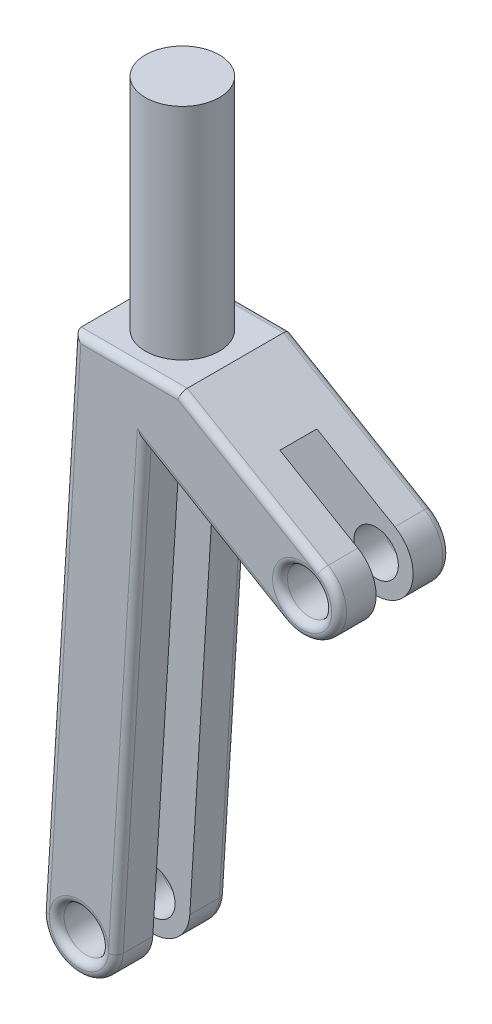
ISO-10303-21;
HEADER;
FILE_DESCRIPTION(('STEP AP214'),'2;1');
FILE_NAME('part.step','',(''),(''),'','','');
FILE_SCHEMA(('AUTOMOTIVE_DESIGN { 1 0 10303 214 1 1 1 1 }'));
ENDSEC;
DATA;
#1=APPLICATION_CONTEXT('core data for automotive mechanical design processes');
#2=APPLICATION_PROTOCOL_DEFINITION('international standard','automotive_design',2000,#1);
#3=PRODUCT_CONTEXT('',#1,'mechanical');
#4=PRODUCT('Part','Part','',(#3));
#5=PRODUCT_RELATED_PRODUCT_CATEGORY('part','',(#4));
#6=PRODUCT_DEFINITION_FORMATION('','',#4);
#7=PRODUCT_DEFINITION_CONTEXT('part definition',#1,'design');
#8=PRODUCT_DEFINITION('design','',#6,#7);
#9=PRODUCT_DEFINITION_SHAPE('','',#8);
#10=(LENGTH_UNIT() NAMED_UNIT(*) SI_UNIT(.MILLI.,.METRE.));
#11=(NAMED_UNIT(*) PLANE_ANGLE_UNIT() SI_UNIT($,.RADIAN.));
#12=(NAMED_UNIT(*) SI_UNIT($,.STERADIAN.) SOLID_ANGLE_UNIT());
#13=UNCERTAINTY_MEASURE_WITH_UNIT(LENGTH_MEASURE(1.E-05),#10,'distance_accuracy_value','');
#14=(GEOMETRIC_REPRESENTATION_CONTEXT(3) GLOBAL_UNCERTAINTY_ASSIGNED_CONTEXT((#13)) GLOBAL_UNIT_ASSIGNED_CONTEXT((#10,
#11,#12)) REPRESENTATION_CONTEXT('',''));
#15=CARTESIAN_POINT('',(0.,0.,0.));
#16=DIRECTION('',(0.,0.,1.));
#17=DIRECTION('',(1.,0.,0.));
#18=AXIS2_PLACEMENT_3D('',#15,#16,#17);
#19=CARTESIAN_POINT('',(61.4599769573422,104.642233340965,2.5));
#20=DIRECTION('',(0.506442852633937,0.862273527957342,0.));
#21=DIRECTION('',(-0.862273527957342,0.506442852633937,0.));
#22=AXIS2_PLACEMENT_3D('',#19,#20,#21);
#23=PLANE('',#22);
#24=DIRECTION('',(0.,0.,-1.));
#25=VECTOR('',#24,1.);
#26=CARTESIAN_POINT('',(28.6398220739108,123.918637317355,2.5));
#27=LINE('',#26,#25);
#28=CARTESIAN_POINT('',(28.6398220739108,123.918637317355,2.5));
#29=VERTEX_POINT('',#28);
#30=CARTESIAN_POINT('',(28.6398220739108,123.918637317355,0.5));
#31=VERTEX_POINT('',#30);
#32=EDGE_CURVE('E277',#29,#31,#27,.T.);
#33=ORIENTED_EDGE('',*,*,#32,.T.);
#34=DIRECTION('',(0.862273527957342,-0.506442852633937,0.));
#35=VECTOR('',#34,1.);
#36=CARTESIAN_POINT('',(19.1138774160616,129.513551726919,0.5));
#37=LINE('',#36,#35);
#38=CARTESIAN_POINT('',(19.1138774160616,129.513551726919,0.5));
#39=VERTEX_POINT('',#38);
#40=EDGE_CURVE('E329',#31,#39,#37,.F.);
#41=ORIENTED_EDGE('',*,*,#40,.T.);
#42=DIRECTION('',(0.,0.,-1.));
#43=VECTOR('',#42,1.);
#44=CARTESIAN_POINT('',(19.1138774160616,129.513551726919,3.75));
#45=LINE('',#44,#43);
#46=CARTESIAN_POINT('',(19.1138774160616,129.513551726919,7.));
#47=VERTEX_POINT('',#46);
#48=EDGE_CURVE('E208',#47,#39,#45,.T.);
#49=ORIENTED_EDGE('',*,*,#48,.F.);
#50=DIRECTION('',(0.862273527957342,-0.506442852633937,0.));
#51=VECTOR('',#50,1.);
#52=CARTESIAN_POINT('',(28.6398220739108,123.918637317355,7.));
#53=LINE('',#52,#51);
#54=CARTESIAN_POINT('',(28.6398220739108,123.918637317355,7.));
#55=VERTEX_POINT('',#54);
#56=EDGE_CURVE('E327',#47,#55,#53,.T.);
#57=ORIENTED_EDGE('',*,*,#56,.T.);
#58=DIRECTION('',(0.,0.,1.));
#59=VECTOR('',#58,1.);
#60=CARTESIAN_POINT('',(28.6398220739108,123.918637317355,5.));
#61=LINE('',#60,#59);
#62=CARTESIAN_POINT('',(28.6398220739108,123.918637317355,5.));
#63=VERTEX_POINT('',#62);
#64=EDGE_CURVE('E222',#63,#55,#61,.T.);
#65=ORIENTED_EDGE('',*,*,#64,.F.);
#66=DIRECTION('',(0.862273527957342,-0.506442852633937,0.));
#67=VECTOR('',#66,1.);
#68=CARTESIAN_POINT('',(61.4599769573422,104.642233340965,5.));
#69=LINE('',#68,#67);
#70=CARTESIAN_POINT('',(23.3703968015795,127.013551726919,5.));
#71=VERTEX_POINT('',#70);
#72=EDGE_CURVE('E214',#71,#63,#69,.T.);
#73=ORIENTED_EDGE('',*,*,#72,.F.);
#74=DIRECTION('',(0.,0.,-1.));
#75=VECTOR('',#74,1.);
#76=CARTESIAN_POINT('',(23.3703968015795,127.013551726919,3.75));
#77=LINE('',#76,#75);
#78=CARTESIAN_POINT('',(23.3703968015795,127.013551726919,2.5));
#79=VERTEX_POINT('',#78);
#80=EDGE_CURVE('E198',#71,#79,#77,.T.);
#81=ORIENTED_EDGE('',*,*,#80,.T.);
#82=DIRECTION('',(0.862273527957342,-0.506442852633937,0.));
#83=VECTOR('',#82,1.);
#84=CARTESIAN_POINT('',(61.4599769573422,104.642233340965,2.5));
#85=LINE('',#84,#83);
#86=EDGE_CURVE('E257',#79,#29,#85,.T.);
#87=ORIENTED_EDGE('',*,*,#86,.T.);
#88=EDGE_LOOP('',(#33,#41,#49,#57,#65,#73,#81,#87));
#89=FACE_BOUND('',#88,.T.);
#90=ADVANCED_FACE('F45',(#89),#23,.T.);
#91=CARTESIAN_POINT('',(3.93847108899417,-0.243000831228595,2.5));
#92=DIRECTION('',(0.998102016630387,-0.0615821759793753,0.));
#93=DIRECTION('',(0.0615821759793753,0.998102016630387,0.));
#94=AXIS2_PLACEMENT_3D('',#91,#92,#93);
#95=PLANE('',#94);
#96=DIRECTION('',(0.,0.,-1.));
#97=VECTOR('',#96,1.);
#98=CARTESIAN_POINT('',(11.9443569813899,129.513551726919,2.5));
#99=LINE('',#98,#97);
#100=CARTESIAN_POINT('',(11.9443569813899,129.513551726919,7.));
#101=VERTEX_POINT('',#100);
#102=CARTESIAN_POINT('',(11.9443569813899,129.513551726919,0.5));
#103=VERTEX_POINT('',#102);
#104=EDGE_CURVE('E291',#101,#103,#99,.T.);
#105=ORIENTED_EDGE('',*,*,#104,.T.);
#106=DIRECTION('',(-0.0615821759793753,-0.998102016630387,0.));
#107=VECTOR('',#106,1.);
#108=CARTESIAN_POINT('',(3.93847108899417,-0.243000831228595,0.5));
#109=LINE('',#108,#107);
#110=CARTESIAN_POINT('',(9.78898082211173,94.5799811448554,0.5));
#111=VERTEX_POINT('',#110);
#112=EDGE_CURVE('E337',#103,#111,#109,.T.);
#113=ORIENTED_EDGE('',*,*,#112,.T.);
#114=DIRECTION('',(0.,0.,-1.));
#115=VECTOR('',#114,1.);
#116=CARTESIAN_POINT('',(9.78898082211173,94.5799811448554,2.5));
#117=LINE('',#116,#115);
#118=CARTESIAN_POINT('',(9.78898082211173,94.5799811448554,2.5));
#119=VERTEX_POINT('',#118);
#120=EDGE_CURVE('E288',#119,#111,#117,.T.);
#121=ORIENTED_EDGE('',*,*,#120,.F.);
#122=DIRECTION('',(-0.0615821759793753,-0.998102016630387,0.));
#123=VECTOR('',#122,1.);
#124=CARTESIAN_POINT('',(3.93847108899417,-0.243000831228595,2.5));
#125=LINE('',#124,#123);
#126=CARTESIAN_POINT('',(11.7901087809221,127.013551726919,2.5));
#127=VERTEX_POINT('',#126);
#128=EDGE_CURVE('E259',#127,#119,#125,.T.);
#129=ORIENTED_EDGE('',*,*,#128,.F.);
#130=DIRECTION('',(0.,0.,-1.));
#131=VECTOR('',#130,1.);
#132=CARTESIAN_POINT('',(11.7901087809221,127.013551726919,3.75));
#133=LINE('',#132,#131);
#134=CARTESIAN_POINT('',(11.7901087809221,127.013551726919,5.));
#135=VERTEX_POINT('',#134);
#136=EDGE_CURVE('E207',#135,#127,#133,.T.);
#137=ORIENTED_EDGE('',*,*,#136,.F.);
#138=DIRECTION('',(-0.0615821759793753,-0.998102016630387,0.));
#139=VECTOR('',#138,1.);
#140=CARTESIAN_POINT('',(3.93847108899417,-0.243000831228595,5.));
#141=LINE('',#140,#139);
#142=CARTESIAN_POINT('',(9.78898082211173,94.5799811448554,5.));
#143=VERTEX_POINT('',#142);
#144=EDGE_CURVE('E217',#135,#143,#141,.T.);
#145=ORIENTED_EDGE('',*,*,#144,.T.);
#146=DIRECTION('',(0.,0.,1.));
#147=VECTOR('',#146,1.);
#148=CARTESIAN_POINT('',(9.78898082211173,94.5799811448554,5.));
#149=LINE('',#148,#147);
#150=CARTESIAN_POINT('',(9.78898082211173,94.5799811448554,7.));
#151=VERTEX_POINT('',#150);
#152=EDGE_CURVE('E250',#143,#151,#149,.T.);
#153=ORIENTED_EDGE('',*,*,#152,.T.);
#154=DIRECTION('',(-0.0615821759793753,-0.998102016630387,0.));
#155=VECTOR('',#154,1.);
#156=CARTESIAN_POINT('',(3.93847108899417,-0.243000831228595,7.));
#157=LINE('',#156,#155);
#158=EDGE_CURVE('E335',#151,#101,#157,.F.);
#159=ORIENTED_EDGE('',*,*,#158,.T.);
#160=EDGE_LOOP('',(#105,#113,#121,#129,#137,#145,#153,#159));
#161=FACE_BOUND('',#160,.T.);
#162=ADVANCED_FACE('F428',(#161),#95,.F.);
#163=CARTESIAN_POINT('',(12.2842358636877,94.426025704907,2.5));
#164=DIRECTION('',(0.,0.,-1.));
#165=DIRECTION('',(-1.,0.,0.));
#166=AXIS2_PLACEMENT_3D('',#163,#164,#165);
#167=CYLINDRICAL_SURFACE('',#166,2.5);
#168=ORIENTED_EDGE('',*,*,#120,.T.);
#169=CARTESIAN_POINT('',(12.2842358636877,94.426025704907,0.5));
#170=DIRECTION('',(0.,0.,1.));
#171=DIRECTION('',(1.,0.,0.));
#172=AXIS2_PLACEMENT_3D('',#169,#170,#171);
#173=CIRCLE('',#172,2.5);
#174=CARTESIAN_POINT('',(14.7794909052637,94.2720702649586,0.5));
#175=VERTEX_POINT('',#174);
#176=EDGE_CURVE('E318',#111,#175,#173,.T.);
#177=ORIENTED_EDGE('',*,*,#176,.T.);
#178=DIRECTION('',(0.,0.,-1.));
#179=VECTOR('',#178,1.);
#180=CARTESIAN_POINT('',(14.7794909052637,94.2720702649586,2.5));
#181=LINE('',#180,#179);
#182=CARTESIAN_POINT('',(14.7794909052637,94.2720702649586,2.5));
#183=VERTEX_POINT('',#182);
#184=EDGE_CURVE('E285',#183,#175,#181,.T.);
#185=ORIENTED_EDGE('',*,*,#184,.F.);
#186=CARTESIAN_POINT('',(12.2842358636877,94.426025704907,2.5));
#187=DIRECTION('',(0.,0.,1.));
#188=DIRECTION('',(1.,0.,0.));
#189=AXIS2_PLACEMENT_3D('',#186,#187,#188);
#190=CIRCLE('',#189,2.5);
#191=EDGE_CURVE('E261',#119,#183,#190,.T.);
#192=ORIENTED_EDGE('',*,*,#191,.F.);
#193=EDGE_LOOP('',(#168,#177,#185,#192));
#194=FACE_BOUND('',#193,.T.);
#195=ADVANCED_FACE('F460',(#194),#167,.T.);
#196=CARTESIAN_POINT('',(8.92898117214608,-0.550911711125472,2.5));
#197=DIRECTION('',(0.998102016630387,-0.0615821759793755,0.));
#198=DIRECTION('',(0.0615821759793755,0.998102016630387,0.));
#199=AXIS2_PLACEMENT_3D('',#196,#197,#198);
#200=PLANE('',#199);
#201=ORIENTED_EDGE('',*,*,#184,.T.);
#202=DIRECTION('',(-0.0615821759793755,-0.998102016630387,0.));
#203=VECTOR('',#202,1.);
#204=CARTESIAN_POINT('',(16.6841429890366,125.141994160303,0.5));
#205=LINE('',#204,#203);
#206=CARTESIAN_POINT('',(16.6841429890366,125.141994160303,0.5));
#207=VERTEX_POINT('',#206);
#208=EDGE_CURVE('E321',#175,#207,#205,.F.);
#209=ORIENTED_EDGE('',*,*,#208,.T.);
#210=DIRECTION('',(0.,0.,-1.));
#211=VECTOR('',#210,1.);
#212=CARTESIAN_POINT('',(16.6841429890366,125.141994160303,2.5));
#213=LINE('',#212,#211);
#214=CARTESIAN_POINT('',(16.6841429890366,125.141994160303,2.5));
#215=VERTEX_POINT('',#214);
#216=EDGE_CURVE('E282',#215,#207,#213,.T.);
#217=ORIENTED_EDGE('',*,*,#216,.F.);
#218=DIRECTION('',(-0.0615821759793756,-0.998102016630387,0.));
#219=VECTOR('',#218,1.);
#220=CARTESIAN_POINT('',(8.92898117214608,-0.550911711125472,2.5));
#221=LINE('',#220,#219);
#222=EDGE_CURVE('E263',#215,#183,#221,.T.);
#223=ORIENTED_EDGE('',*,*,#222,.T.);
#224=EDGE_LOOP('',(#201,#209,#217,#223));
#225=FACE_BOUND('',#224,.T.);
#226=ADVANCED_FACE('F471',(#225),#200,.T.);
#227=CARTESIAN_POINT('',(58.9277626941718,100.330865701179,2.5));
#228=DIRECTION('',(0.506442852633929,0.862273527957346,0.));
#229=DIRECTION('',(-0.862273527957346,0.506442852633929,0.));
#230=AXIS2_PLACEMENT_3D('',#227,#228,#229);
#231=PLANE('',#230);
#232=ORIENTED_EDGE('',*,*,#216,.T.);
#233=DIRECTION('',(0.862273527957346,-0.506442852633929,0.));
#234=VECTOR('',#233,1.);
#235=CARTESIAN_POINT('',(58.9277626941718,100.330865701179,0.5));
#236=LINE('',#235,#234);
#237=CARTESIAN_POINT('',(26.1076078107412,119.607269677568,0.5));
#238=VERTEX_POINT('',#237);
#239=EDGE_CURVE('E323',#207,#238,#236,.T.);
#240=ORIENTED_EDGE('',*,*,#239,.T.);
#241=DIRECTION('',(0.,0.,-1.));
#242=VECTOR('',#241,1.);
#243=CARTESIAN_POINT('',(26.1076078107412,119.607269677568,2.5));
#244=LINE('',#243,#242);
#245=CARTESIAN_POINT('',(26.1076078107412,119.607269677568,2.5));
#246=VERTEX_POINT('',#245);
#247=EDGE_CURVE('E279',#246,#238,#244,.T.);
#248=ORIENTED_EDGE('',*,*,#247,.F.);
#249=DIRECTION('',(0.862273527957346,-0.506442852633929,0.));
#250=VECTOR('',#249,1.);
#251=CARTESIAN_POINT('',(58.9277626941718,100.330865701179,2.5));
#252=LINE('',#251,#250);
#253=EDGE_CURVE('E266',#215,#246,#252,.T.);
#254=ORIENTED_EDGE('',*,*,#253,.F.);
#255=EDGE_LOOP('',(#232,#240,#248,#254));
#256=FACE_BOUND('',#255,.T.);
#257=ADVANCED_FACE('F474',(#256),#231,.F.);
#258=CARTESIAN_POINT('',(12.2842358636877,94.426025704907,2.5));
#259=DIRECTION('',(0.,0.,-1.));
#260=DIRECTION('',(-1.,0.,0.));
#261=AXIS2_PLACEMENT_3D('',#258,#259,#260);
#262=CYLINDRICAL_SURFACE('',#261,1.50000000000004);
#263=CARTESIAN_POINT('',(12.2842358636877,94.426025704907,0.5));
#264=DIRECTION('',(0.,0.,1.));
#265=DIRECTION('',(1.,0.,0.));
#266=AXIS2_PLACEMENT_3D('',#263,#264,#265);
#267=CIRCLE('',#266,1.50000000000004);
#268=CARTESIAN_POINT('',(13.7842358636877,94.426025704907,0.5));
#269=VERTEX_POINT('',#268);
#270=EDGE_CURVE('E315',#269,#269,#267,.F.);
#271=ORIENTED_EDGE('',*,*,#270,.T.);
#272=EDGE_LOOP('',(#271));
#273=FACE_BOUND('',#272,.T.);
#274=CARTESIAN_POINT('',(12.2842358636877,94.426025704907,2.5));
#275=DIRECTION('',(0.,0.,1.));
#276=DIRECTION('',(1.,0.,0.));
#277=AXIS2_PLACEMENT_3D('',#274,#275,#276);
#278=CIRCLE('',#277,1.50000000000004);
#279=CARTESIAN_POINT('',(13.7842358636877,94.426025704907,2.5));
#280=VERTEX_POINT('',#279);
#281=EDGE_CURVE('E271',#280,#280,#278,.T.);
#282=ORIENTED_EDGE('',*,*,#281,.T.);
#283=EDGE_LOOP('',(#282));
#284=FACE_BOUND('',#283,.T.);
#285=ADVANCED_FACE('F515',(#273,#284),#262,.F.);
#286=CARTESIAN_POINT('',(27.373714942326,121.762953497462,2.5));
#287=DIRECTION('',(0.,0.,-1.));
#288=DIRECTION('',(-1.,0.,0.));
#289=AXIS2_PLACEMENT_3D('',#286,#287,#288);
#290=CYLINDRICAL_SURFACE('',#289,2.49999999999998);
#291=ORIENTED_EDGE('',*,*,#247,.T.);
#292=CARTESIAN_POINT('',(27.373714942326,121.762953497462,0.5));
#293=DIRECTION('',(0.,0.,1.));
#294=DIRECTION('',(1.,0.,0.));
#295=AXIS2_PLACEMENT_3D('',#292,#293,#294);
#296=CIRCLE('',#295,2.49999999999998);
#297=EDGE_CURVE('E325',#238,#31,#296,.T.);
#298=ORIENTED_EDGE('',*,*,#297,.T.);
#299=ORIENTED_EDGE('',*,*,#32,.F.);
#300=CARTESIAN_POINT('',(27.373714942326,121.762953497462,2.5));
#301=DIRECTION('',(0.,0.,1.));
#302=DIRECTION('',(1.,0.,0.));
#303=AXIS2_PLACEMENT_3D('',#300,#301,#302);
#304=CIRCLE('',#303,2.49999999999998);
#305=EDGE_CURVE('E268',#246,#29,#304,.T.);
#306=ORIENTED_EDGE('',*,*,#305,.F.);
#307=EDGE_LOOP('',(#291,#298,#299,#306));
#308=FACE_BOUND('',#307,.T.);
#309=ADVANCED_FACE('F483',(#308),#290,.T.);
#310=CARTESIAN_POINT('',(27.373714942326,121.762953497462,2.5));
#311=DIRECTION('',(0.,0.,-1.));
#312=DIRECTION('',(-1.,0.,0.));
#313=AXIS2_PLACEMENT_3D('',#310,#311,#312);
#314=CYLINDRICAL_SURFACE('',#313,1.50000000000002);
#315=CARTESIAN_POINT('',(27.373714942326,121.762953497462,0.5));
#316=DIRECTION('',(0.,0.,1.));
#317=DIRECTION('',(1.,0.,0.));
#318=AXIS2_PLACEMENT_3D('',#315,#316,#317);
#319=CIRCLE('',#318,1.50000000000002);
#320=CARTESIAN_POINT('',(28.873714942326,121.762953497462,0.5));
#321=VERTEX_POINT('',#320);
#322=EDGE_CURVE('E312',#321,#321,#319,.F.);
#323=ORIENTED_EDGE('',*,*,#322,.T.);
#324=EDGE_LOOP('',(#323));
#325=FACE_BOUND('',#324,.T.);
#326=CARTESIAN_POINT('',(27.373714942326,121.762953497462,2.5));
#327=DIRECTION('',(0.,0.,1.));
#328=DIRECTION('',(1.,0.,0.));
#329=AXIS2_PLACEMENT_3D('',#326,#327,#328);
#330=CIRCLE('',#329,1.50000000000002);
#331=CARTESIAN_POINT('',(28.873714942326,121.762953497462,2.5));
#332=VERTEX_POINT('',#331);
#333=EDGE_CURVE('E274',#332,#332,#330,.T.);
#334=ORIENTED_EDGE('',*,*,#333,.T.);
#335=EDGE_LOOP('',(#334));
#336=FACE_BOUND('',#335,.T.);
#337=ADVANCED_FACE('F518',(#325,#336),#314,.F.);
#338=CARTESIAN_POINT('',(0.,0.,2.5));
#339=DIRECTION('',(0.,0.,1.));
#340=DIRECTION('',(1.,0.,0.));
#341=AXIS2_PLACEMENT_3D('',#338,#339,#340);
#342=PLANE('',#341);
#343=DIRECTION('',(1.,0.,0.));
#344=VECTOR('',#343,1.);
#345=CARTESIAN_POINT('',(11.7901087809221,127.013551726919,2.5));
#346=LINE('',#345,#344);
#347=EDGE_CURVE('E204',#127,#79,#346,.T.);
#348=ORIENTED_EDGE('',*,*,#347,.F.);
#349=ORIENTED_EDGE('',*,*,#128,.T.);
#350=ORIENTED_EDGE('',*,*,#191,.T.);
#351=ORIENTED_EDGE('',*,*,#222,.F.);
#352=ORIENTED_EDGE('',*,*,#253,.T.);
#353=ORIENTED_EDGE('',*,*,#305,.T.);
#354=ORIENTED_EDGE('',*,*,#86,.F.);
#355=EDGE_LOOP('',(#348,#349,#350,#351,#352,#353,#354));
#356=FACE_BOUND('',#355,.T.);
#357=ORIENTED_EDGE('',*,*,#281,.F.);
#358=EDGE_LOOP('',(#357));
#359=FACE_BOUND('',#358,.T.);
#360=ORIENTED_EDGE('',*,*,#333,.F.);
#361=EDGE_LOOP('',(#360));
#362=FACE_BOUND('',#361,.T.);
#363=ADVANCED_FACE('F479',(#356,#359,#362),#342,.T.);
#364=CARTESIAN_POINT('',(0.,0.,0.));
#365=DIRECTION('',(0.,0.,1.));
#366=DIRECTION('',(1.,0.,0.));
#367=AXIS2_PLACEMENT_3D('',#364,#365,#366);
#368=PLANE('',#367);
#369=DIRECTION('',(-0.0615821759793755,-0.998102016630387,0.));
#370=VECTOR('',#369,1.);
#371=CARTESIAN_POINT('',(14.2804398969485,94.3028613529483,0.));
#372=LINE('',#371,#370);
#373=CARTESIAN_POINT('',(16.2352367958224,125.985514585636,0.));
#374=VERTEX_POINT('',#373);
#375=CARTESIAN_POINT('',(14.2804398969485,94.3028613529483,0.));
#376=VERTEX_POINT('',#375);
#377=EDGE_CURVE('E308',#374,#376,#372,.T.);
#378=ORIENTED_EDGE('',*,*,#377,.T.);
#379=CARTESIAN_POINT('',(12.2842358636877,94.426025704907,0.));
#380=DIRECTION('',(0.,0.,1.));
#381=DIRECTION('',(1.,0.,0.));
#382=AXIS2_PLACEMENT_3D('',#379,#380,#381);
#383=CIRCLE('',#382,2.00000000000004);
#384=CARTESIAN_POINT('',(14.2842358636877,94.426025704907,0.));
#385=VERTEX_POINT('',#384);
#386=EDGE_CURVE('E310',#376,#385,#383,.T.);
#387=ORIENTED_EDGE('',*,*,#386,.T.);
#388=CARTESIAN_POINT('',(12.2842358636877,94.426025704907,0.));
#389=DIRECTION('',(0.,0.,1.));
#390=DIRECTION('',(1.,0.,0.));
#391=AXIS2_PLACEMENT_3D('',#388,#389,#390);
#392=CIRCLE('',#391,2.00000000000004);
#393=CARTESIAN_POINT('',(10.2880318304269,94.5491900568658,0.));
#394=VERTEX_POINT('',#393);
#395=EDGE_CURVE('E301',#385,#394,#392,.T.);
#396=ORIENTED_EDGE('',*,*,#395,.T.);
#397=DIRECTION('',(-0.0615821759793753,-0.998102016630387,0.));
#398=VECTOR('',#397,1.);
#399=CARTESIAN_POINT('',(4.43752209730937,-0.273791919218283,0.));
#400=LINE('',#399,#398);
#401=CARTESIAN_POINT('',(12.4144581375767,129.013551726919,0.));
#402=VERTEX_POINT('',#401);
#403=EDGE_CURVE('E295',#394,#402,#400,.F.);
#404=ORIENTED_EDGE('',*,*,#403,.T.);
#405=DIRECTION('',(1.,0.,0.));
#406=VECTOR('',#405,1.);
#407=CARTESIAN_POINT('',(0.,129.013551726919,0.));
#408=LINE('',#407,#406);
#409=CARTESIAN_POINT('',(18.9779030693744,129.013551726919,0.));
#410=VERTEX_POINT('',#409);
#411=EDGE_CURVE('E297',#402,#410,#408,.T.);
#412=ORIENTED_EDGE('',*,*,#411,.T.);
#413=DIRECTION('',(0.862273527957342,-0.506442852633937,0.));
#414=VECTOR('',#413,1.);
#415=CARTESIAN_POINT('',(28.3866006475938,123.487500553376,0.));
#416=LINE('',#415,#414);
#417=CARTESIAN_POINT('',(28.3866006475939,123.487500553376,0.));
#418=VERTEX_POINT('',#417);
#419=EDGE_CURVE('E299',#410,#418,#416,.T.);
#420=ORIENTED_EDGE('',*,*,#419,.T.);
#421=CARTESIAN_POINT('',(27.373714942326,121.762953497462,0.));
#422=DIRECTION('',(0.,0.,1.));
#423=DIRECTION('',(1.,0.,0.));
#424=AXIS2_PLACEMENT_3D('',#421,#422,#423);
#425=CIRCLE('',#424,2.00000000000002);
#426=CARTESIAN_POINT('',(26.3608292370581,120.038406441547,0.));
#427=VERTEX_POINT('',#426);
#428=EDGE_CURVE('E303',#418,#427,#425,.T.);
#429=ORIENTED_EDGE('',*,*,#428,.T.);
#430=DIRECTION('',(0.862273527957346,-0.506442852633929,0.));
#431=VECTOR('',#430,1.);
#432=CARTESIAN_POINT('',(59.1809841204888,100.762002465158,0.));
#433=LINE('',#432,#431);
#434=EDGE_CURVE('E306',#427,#374,#433,.F.);
#435=ORIENTED_EDGE('',*,*,#434,.T.);
#436=EDGE_LOOP('',(#378,#387,#396,#404,#412,#420,#429,#435));
#437=FACE_BOUND('',#436,.T.);
#438=ADVANCED_FACE('F447',(#437),#368,.F.);
#439=CARTESIAN_POINT('',(11.7901087809221,127.013551726919,3.75));
#440=DIRECTION('',(0.,1.,0.));
#441=DIRECTION('',(0.,0.,1.));
#442=AXIS2_PLACEMENT_3D('',#439,#440,#441);
#443=PLANE('',#442);
#444=ORIENTED_EDGE('',*,*,#347,.T.);
#445=ORIENTED_EDGE('',*,*,#80,.F.);
#446=DIRECTION('',(1.,0.,0.));
#447=VECTOR('',#446,1.);
#448=CARTESIAN_POINT('',(11.7901087809221,127.013551726919,5.));
#449=LINE('',#448,#447);
#450=EDGE_CURVE('E202',#135,#71,#449,.T.);
#451=ORIENTED_EDGE('',*,*,#450,.F.);
#452=ORIENTED_EDGE('',*,*,#136,.T.);
#453=EDGE_LOOP('',(#444,#445,#451,#452));
#454=FACE_BOUND('',#453,.T.);
#455=ADVANCED_FACE('F200',(#454),#443,.F.);
#456=CARTESIAN_POINT('',(11.9443569813899,129.513551726919,3.75));
#457=DIRECTION('',(0.,-1.,0.));
#458=DIRECTION('',(0.,0.,-1.));
#459=AXIS2_PLACEMENT_3D('',#456,#457,#458);
#460=PLANE('',#459);
#461=CARTESIAN_POINT('',(15.5291171987257,129.513551726919,3.75));
#462=DIRECTION('',(0.,1.,0.));
#463=DIRECTION('',(0.,0.,1.));
#464=AXIS2_PLACEMENT_3D('',#461,#462,#463);
#465=CIRCLE('',#464,2.5);
#466=CARTESIAN_POINT('',(15.5291171987257,129.513551726919,6.25));
#467=VERTEX_POINT('',#466);
#468=EDGE_CURVE('E294',#467,#467,#465,.T.);
#469=ORIENTED_EDGE('',*,*,#468,.F.);
#470=EDGE_LOOP('',(#469));
#471=FACE_BOUND('',#470,.T.);
#472=ORIENTED_EDGE('',*,*,#48,.T.);
#473=DIRECTION('',(1.,0.,0.));
#474=VECTOR('',#473,1.);
#475=CARTESIAN_POINT('',(11.9443569813899,129.513551726919,0.5));
#476=LINE('',#475,#474);
#477=EDGE_CURVE('E333',#39,#103,#476,.F.);
#478=ORIENTED_EDGE('',*,*,#477,.T.);
#479=ORIENTED_EDGE('',*,*,#104,.F.);
#480=DIRECTION('',(1.,0.,0.));
#481=VECTOR('',#480,1.);
#482=CARTESIAN_POINT('',(11.9443569813899,129.513551726919,7.));
#483=LINE('',#482,#481);
#484=EDGE_CURVE('E331',#101,#47,#483,.T.);
#485=ORIENTED_EDGE('',*,*,#484,.T.);
#486=EDGE_LOOP('',(#472,#478,#479,#485));
#487=FACE_BOUND('',#486,.T.);
#488=ADVANCED_FACE('F432',(#471,#487),#460,.F.);
#489=CARTESIAN_POINT('',(12.2842358636877,94.426025704907,5.));
#490=DIRECTION('',(0.,0.,1.));
#491=DIRECTION('',(-1.,0.,0.));
#492=AXIS2_PLACEMENT_3D('',#489,#490,#491);
#493=CYLINDRICAL_SURFACE('',#492,2.5);
#494=DIRECTION('',(0.,0.,1.));
#495=VECTOR('',#494,1.);
#496=CARTESIAN_POINT('',(14.7794909052637,94.2720702649586,5.));
#497=LINE('',#496,#495);
#498=CARTESIAN_POINT('',(14.7794909052637,94.2720702649586,5.));
#499=VERTEX_POINT('',#498);
#500=CARTESIAN_POINT('',(14.7794909052637,94.2720702649586,7.));
#501=VERTEX_POINT('',#500);
#502=EDGE_CURVE('E248',#499,#501,#497,.T.);
#503=ORIENTED_EDGE('',*,*,#502,.T.);
#504=CARTESIAN_POINT('',(12.2842358636877,94.426025704907,7.));
#505=DIRECTION('',(0.,0.,-1.));
#506=DIRECTION('',(-1.,0.,0.));
#507=AXIS2_PLACEMENT_3D('',#504,#505,#506);
#508=CIRCLE('',#507,2.5);
#509=EDGE_CURVE('E11',#501,#151,#508,.T.);
#510=ORIENTED_EDGE('',*,*,#509,.T.);
#511=ORIENTED_EDGE('',*,*,#152,.F.);
#512=CARTESIAN_POINT('',(12.2842358636877,94.426025704907,5.));
#513=DIRECTION('',(0.,0.,1.));
#514=DIRECTION('',(1.,0.,0.));
#515=AXIS2_PLACEMENT_3D('',#512,#513,#514);
#516=CIRCLE('',#515,2.5);
#517=EDGE_CURVE('E224',#143,#499,#516,.T.);
#518=ORIENTED_EDGE('',*,*,#517,.T.);
#519=EDGE_LOOP('',(#503,#510,#511,#518));
#520=FACE_BOUND('',#519,.T.);
#521=ADVANCED_FACE('F533',(#520),#493,.T.);
#522=CARTESIAN_POINT('',(8.92898117214608,-0.550911711125472,5.));
#523=DIRECTION('',(0.998102016630387,-0.0615821759793755,0.));
#524=DIRECTION('',(0.0615821759793755,0.998102016630387,0.));
#525=AXIS2_PLACEMENT_3D('',#522,#523,#524);
#526=PLANE('',#525);
#527=DIRECTION('',(0.,0.,1.));
#528=VECTOR('',#527,1.);
#529=CARTESIAN_POINT('',(16.6841429890366,125.141994160303,5.));
#530=LINE('',#529,#528);
#531=CARTESIAN_POINT('',(16.6841429890366,125.141994160303,5.));
#532=VERTEX_POINT('',#531);
#533=CARTESIAN_POINT('',(16.6841429890366,125.141994160303,7.));
#534=VERTEX_POINT('',#533);
#535=EDGE_CURVE('E246',#532,#534,#530,.T.);
#536=ORIENTED_EDGE('',*,*,#535,.T.);
#537=DIRECTION('',(-0.0615821759793755,-0.998102016630387,0.));
#538=VECTOR('',#537,1.);
#539=CARTESIAN_POINT('',(14.7794909052637,94.2720702649586,7.));
#540=LINE('',#539,#538);
#541=EDGE_CURVE('E54',#534,#501,#540,.T.);
#542=ORIENTED_EDGE('',*,*,#541,.T.);
#543=ORIENTED_EDGE('',*,*,#502,.F.);
#544=DIRECTION('',(-0.0615821759793756,-0.998102016630387,0.));
#545=VECTOR('',#544,1.);
#546=CARTESIAN_POINT('',(8.92898117214608,-0.550911711125472,5.));
#547=LINE('',#546,#545);
#548=EDGE_CURVE('E230',#532,#499,#547,.T.);
#549=ORIENTED_EDGE('',*,*,#548,.F.);
#550=EDGE_LOOP('',(#536,#542,#543,#549));
#551=FACE_BOUND('',#550,.T.);
#552=ADVANCED_FACE('F537',(#551),#526,.T.);
#553=CARTESIAN_POINT('',(58.9277626941718,100.330865701179,5.));
#554=DIRECTION('',(0.506442852633929,0.862273527957346,0.));
#555=DIRECTION('',(-0.862273527957346,0.506442852633929,0.));
#556=AXIS2_PLACEMENT_3D('',#553,#554,#555);
#557=PLANE('',#556);
#558=DIRECTION('',(0.,0.,1.));
#559=VECTOR('',#558,1.);
#560=CARTESIAN_POINT('',(26.1076078107412,119.607269677568,5.));
#561=LINE('',#560,#559);
#562=CARTESIAN_POINT('',(26.1076078107412,119.607269677568,5.));
#563=VERTEX_POINT('',#562);
#564=CARTESIAN_POINT('',(26.1076078107412,119.607269677568,7.));
#565=VERTEX_POINT('',#564);
#566=EDGE_CURVE('E244',#563,#565,#561,.T.);
#567=ORIENTED_EDGE('',*,*,#566,.T.);
#568=DIRECTION('',(0.862273527957346,-0.506442852633929,0.));
#569=VECTOR('',#568,1.);
#570=CARTESIAN_POINT('',(58.9277626941718,100.330865701179,7.));
#571=LINE('',#570,#569);
#572=EDGE_CURVE('E69',#565,#534,#571,.F.);
#573=ORIENTED_EDGE('',*,*,#572,.T.);
#574=ORIENTED_EDGE('',*,*,#535,.F.);
#575=DIRECTION('',(0.862273527957346,-0.506442852633929,0.));
#576=VECTOR('',#575,1.);
#577=CARTESIAN_POINT('',(58.9277626941718,100.330865701179,5.));
#578=LINE('',#577,#576);
#579=EDGE_CURVE('E232',#532,#563,#578,.T.);
#580=ORIENTED_EDGE('',*,*,#579,.T.);
#581=EDGE_LOOP('',(#567,#573,#574,#580));
#582=FACE_BOUND('',#581,.T.);
#583=ADVANCED_FACE('F541',(#582),#557,.F.);
#584=CARTESIAN_POINT('',(12.2842358636877,94.426025704907,5.));
#585=DIRECTION('',(0.,0.,1.));
#586=DIRECTION('',(-1.,0.,0.));
#587=AXIS2_PLACEMENT_3D('',#584,#585,#586);
#588=CYLINDRICAL_SURFACE('',#587,1.50000000000004);
#589=CARTESIAN_POINT('',(12.2842358636877,94.426025704907,7.));
#590=DIRECTION('',(0.,0.,-1.));
#591=DIRECTION('',(-1.,0.,0.));
#592=AXIS2_PLACEMENT_3D('',#589,#590,#591);
#593=CIRCLE('',#592,1.50000000000004);
#594=CARTESIAN_POINT('',(10.7842358636877,94.426025704907,7.));
#595=VERTEX_POINT('',#594);
#596=EDGE_CURVE('E359',#595,#595,#593,.F.);
#597=ORIENTED_EDGE('',*,*,#596,.T.);
#598=EDGE_LOOP('',(#597));
#599=FACE_BOUND('',#598,.T.);
#600=CARTESIAN_POINT('',(12.2842358636877,94.426025704907,5.));
#601=DIRECTION('',(0.,0.,1.));
#602=DIRECTION('',(1.,0.,0.));
#603=AXIS2_PLACEMENT_3D('',#600,#601,#602);
#604=CIRCLE('',#603,1.50000000000004);
#605=CARTESIAN_POINT('',(13.7842358636877,94.426025704907,5.));
#606=VERTEX_POINT('',#605);
#607=EDGE_CURVE('E237',#606,#606,#604,.T.);
#608=ORIENTED_EDGE('',*,*,#607,.F.);
#609=EDGE_LOOP('',(#608));
#610=FACE_BOUND('',#609,.T.);
#611=ADVANCED_FACE('F544',(#599,#610),#588,.F.);
#612=CARTESIAN_POINT('',(27.373714942326,121.762953497462,5.));
#613=DIRECTION('',(0.,0.,1.));
#614=DIRECTION('',(-1.,0.,0.));
#615=AXIS2_PLACEMENT_3D('',#612,#613,#614);
#616=CYLINDRICAL_SURFACE('',#615,2.49999999999998);
#617=ORIENTED_EDGE('',*,*,#64,.T.);
#618=CARTESIAN_POINT('',(27.373714942326,121.762953497462,7.));
#619=DIRECTION('',(0.,0.,-1.));
#620=DIRECTION('',(-1.,0.,0.));
#621=AXIS2_PLACEMENT_3D('',#618,#619,#620);
#622=CIRCLE('',#621,2.49999999999998);
#623=EDGE_CURVE('E362',#55,#565,#622,.T.);
#624=ORIENTED_EDGE('',*,*,#623,.T.);
#625=ORIENTED_EDGE('',*,*,#566,.F.);
#626=CARTESIAN_POINT('',(27.373714942326,121.762953497462,5.));
#627=DIRECTION('',(0.,0.,1.));
#628=DIRECTION('',(1.,0.,0.));
#629=AXIS2_PLACEMENT_3D('',#626,#627,#628);
#630=CIRCLE('',#629,2.49999999999998);
#631=EDGE_CURVE('E235',#563,#63,#630,.T.);
#632=ORIENTED_EDGE('',*,*,#631,.T.);
#633=EDGE_LOOP('',(#617,#624,#625,#632));
#634=FACE_BOUND('',#633,.T.);
#635=ADVANCED_FACE('F545',(#634),#616,.T.);
#636=CARTESIAN_POINT('',(27.373714942326,121.762953497462,5.));
#637=DIRECTION('',(0.,0.,1.));
#638=DIRECTION('',(-1.,0.,0.));
#639=AXIS2_PLACEMENT_3D('',#636,#637,#638);
#640=CYLINDRICAL_SURFACE('',#639,1.50000000000002);
#641=CARTESIAN_POINT('',(27.373714942326,121.762953497462,7.));
#642=DIRECTION('',(0.,0.,-1.));
#643=DIRECTION('',(-1.,0.,0.));
#644=AXIS2_PLACEMENT_3D('',#641,#642,#643);
#645=CIRCLE('',#644,1.50000000000002);
#646=CARTESIAN_POINT('',(25.873714942326,121.762953497462,7.));
#647=VERTEX_POINT('',#646);
#648=EDGE_CURVE('E339',#647,#647,#645,.F.);
#649=ORIENTED_EDGE('',*,*,#648,.T.);
#650=EDGE_LOOP('',(#649));
#651=FACE_BOUND('',#650,.T.);
#652=CARTESIAN_POINT('',(27.373714942326,121.762953497462,5.));
#653=DIRECTION('',(0.,0.,1.));
#654=DIRECTION('',(1.,0.,0.));
#655=AXIS2_PLACEMENT_3D('',#652,#653,#654);
#656=CIRCLE('',#655,1.50000000000002);
#657=CARTESIAN_POINT('',(28.873714942326,121.762953497462,5.));
#658=VERTEX_POINT('',#657);
#659=EDGE_CURVE('E240',#658,#658,#656,.T.);
#660=ORIENTED_EDGE('',*,*,#659,.F.);
#661=EDGE_LOOP('',(#660));
#662=FACE_BOUND('',#661,.T.);
#663=ADVANCED_FACE('F548',(#651,#662),#640,.F.);
#664=CARTESIAN_POINT('',(0.,0.,5.));
#665=DIRECTION('',(0.,0.,-1.));
#666=DIRECTION('',(1.,0.,0.));
#667=AXIS2_PLACEMENT_3D('',#664,#665,#666);
#668=PLANE('',#667);
#669=ORIENTED_EDGE('',*,*,#450,.T.);
#670=ORIENTED_EDGE('',*,*,#72,.T.);
#671=ORIENTED_EDGE('',*,*,#631,.F.);
#672=ORIENTED_EDGE('',*,*,#579,.F.);
#673=ORIENTED_EDGE('',*,*,#548,.T.);
#674=ORIENTED_EDGE('',*,*,#517,.F.);
#675=ORIENTED_EDGE('',*,*,#144,.F.);
#676=EDGE_LOOP('',(#669,#670,#671,#672,#673,#674,#675));
#677=FACE_BOUND('',#676,.T.);
#678=ORIENTED_EDGE('',*,*,#607,.T.);
#679=EDGE_LOOP('',(#678));
#680=FACE_BOUND('',#679,.T.);
#681=ORIENTED_EDGE('',*,*,#659,.T.);
#682=EDGE_LOOP('',(#681));
#683=FACE_BOUND('',#682,.T.);
#684=ADVANCED_FACE('F212',(#677,#680,#683),#668,.T.);
#685=CARTESIAN_POINT('',(0.,0.,7.5));
#686=DIRECTION('',(0.,0.,-1.));
#687=DIRECTION('',(1.,0.,0.));
#688=AXIS2_PLACEMENT_3D('',#685,#686,#687);
#689=PLANE('',#688);
#690=DIRECTION('',(-0.0615821759793755,-0.998102016630387,0.));
#691=VECTOR('',#690,1.);
#692=CARTESIAN_POINT('',(16.1850919807214,125.172785248293,7.5));
#693=LINE('',#692,#691);
#694=CARTESIAN_POINT('',(14.2804398969485,94.3028613529483,7.5));
#695=VERTEX_POINT('',#694);
#696=CARTESIAN_POINT('',(16.2352367958224,125.985514585636,7.5));
#697=VERTEX_POINT('',#696);
#698=EDGE_CURVE('E355',#695,#697,#693,.F.);
#699=ORIENTED_EDGE('',*,*,#698,.T.);
#700=DIRECTION('',(0.862273527957346,-0.506442852633929,0.));
#701=VECTOR('',#700,1.);
#702=CARTESIAN_POINT('',(59.1809841204888,100.762002465158,7.5));
#703=LINE('',#702,#701);
#704=CARTESIAN_POINT('',(26.3608292370581,120.038406441547,7.5));
#705=VERTEX_POINT('',#704);
#706=EDGE_CURVE('E357',#697,#705,#703,.T.);
#707=ORIENTED_EDGE('',*,*,#706,.T.);
#708=CARTESIAN_POINT('',(27.373714942326,121.762953497462,7.5));
#709=DIRECTION('',(0.,0.,-1.));
#710=DIRECTION('',(-1.,0.,0.));
#711=AXIS2_PLACEMENT_3D('',#708,#709,#710);
#712=CIRCLE('',#711,2.00000000000002);
#713=CARTESIAN_POINT('',(28.3866006475939,123.487500553376,7.5));
#714=VERTEX_POINT('',#713);
#715=EDGE_CURVE('E352',#705,#714,#712,.T.);
#716=ORIENTED_EDGE('',*,*,#715,.T.);
#717=DIRECTION('',(0.862273527957342,-0.506442852633937,0.));
#718=VECTOR('',#717,1.);
#719=CARTESIAN_POINT('',(18.8606559897446,129.08241496294,7.5));
#720=LINE('',#719,#718);
#721=CARTESIAN_POINT('',(18.9779030693743,129.013551726919,7.5));
#722=VERTEX_POINT('',#721);
#723=EDGE_CURVE('E342',#714,#722,#720,.F.);
#724=ORIENTED_EDGE('',*,*,#723,.T.);
#725=DIRECTION('',(1.,0.,0.));
#726=VECTOR('',#725,1.);
#727=CARTESIAN_POINT('',(0.,129.013551726919,7.5));
#728=LINE('',#727,#726);
#729=CARTESIAN_POINT('',(12.4144581375767,129.013551726919,7.5));
#730=VERTEX_POINT('',#729);
#731=EDGE_CURVE('E344',#722,#730,#728,.F.);
#732=ORIENTED_EDGE('',*,*,#731,.T.);
#733=DIRECTION('',(-0.0615821759793753,-0.998102016630387,0.));
#734=VECTOR('',#733,1.);
#735=CARTESIAN_POINT('',(4.43752209730936,-0.273791919218283,7.5));
#736=LINE('',#735,#734);
#737=CARTESIAN_POINT('',(10.2880318304269,94.5491900568658,7.5));
#738=VERTEX_POINT('',#737);
#739=EDGE_CURVE('E346',#730,#738,#736,.T.);
#740=ORIENTED_EDGE('',*,*,#739,.T.);
#741=CARTESIAN_POINT('',(12.2842358636877,94.426025704907,7.5));
#742=DIRECTION('',(0.,0.,-1.));
#743=DIRECTION('',(-1.,0.,0.));
#744=AXIS2_PLACEMENT_3D('',#741,#742,#743);
#745=CIRCLE('',#744,2.00000000000004);
#746=CARTESIAN_POINT('',(14.2842358636877,94.426025704907,7.5));
#747=VERTEX_POINT('',#746);
#748=EDGE_CURVE('E348',#738,#747,#745,.T.);
#749=ORIENTED_EDGE('',*,*,#748,.T.);
#750=CARTESIAN_POINT('',(12.2842358636877,94.426025704907,7.5));
#751=DIRECTION('',(0.,0.,-1.));
#752=DIRECTION('',(-1.,0.,0.));
#753=AXIS2_PLACEMENT_3D('',#750,#751,#752);
#754=CIRCLE('',#753,2.00000000000004);
#755=EDGE_CURVE('E350',#747,#695,#754,.T.);
#756=ORIENTED_EDGE('',*,*,#755,.T.);
#757=EDGE_LOOP('',(#699,#707,#716,#724,#732,#740,#749,#756));
#758=FACE_BOUND('',#757,.T.);
#759=ADVANCED_FACE('F556',(#758),#689,.F.);
#760=CARTESIAN_POINT('',(15.5291171987257,144.359596286971,3.75));
#761=DIRECTION('',(0.,-1.,0.));
#762=DIRECTION('',(0.,0.,-1.));
#763=AXIS2_PLACEMENT_3D('',#760,#761,#762);
#764=CYLINDRICAL_SURFACE('',#763,2.5);
#765=CARTESIAN_POINT('',(15.5291171987257,144.359596286971,3.75));
#766=DIRECTION('',(0.,1.,0.));
#767=DIRECTION('',(0.,0.,1.));
#768=AXIS2_PLACEMENT_3D('',#765,#766,#767);
#769=CIRCLE('',#768,2.5);
#770=CARTESIAN_POINT('',(15.5291171987257,144.359596286971,6.25));
#771=VERTEX_POINT('',#770);
#772=EDGE_CURVE('E218',#771,#771,#769,.T.);
#773=ORIENTED_EDGE('',*,*,#772,.F.);
#774=EDGE_LOOP('',(#773));
#775=FACE_BOUND('',#774,.T.);
#776=ORIENTED_EDGE('',*,*,#468,.T.);
#777=EDGE_LOOP('',(#776));
#778=FACE_BOUND('',#777,.T.);
#779=ADVANCED_FACE('F559',(#775,#778),#764,.T.);
#780=CARTESIAN_POINT('',(15.5291171987257,144.359596286971,3.75));
#781=DIRECTION('',(0.,1.,0.));
#782=DIRECTION('',(0.,0.,1.));
#783=AXIS2_PLACEMENT_3D('',#780,#781,#782);
#784=PLANE('',#783);
#785=ORIENTED_EDGE('',*,*,#772,.T.);
#786=EDGE_LOOP('',(#785));
#787=FACE_BOUND('',#786,.T.);
#788=ADVANCED_FACE('F565',(#787),#784,.T.);
#789=CARTESIAN_POINT('',(12.2842358636877,94.426025704907,0.5));
#790=DIRECTION('',(0.,0.,1.));
#791=DIRECTION('',(1.,0.,0.));
#792=AXIS2_PLACEMENT_3D('',#789,#790,#791);
#793=TOROIDAL_SURFACE('',#792,2.00000000000004,0.5);
#794=ORIENTED_EDGE('',*,*,#270,.F.);
#795=EDGE_LOOP('',(#794));
#796=FACE_BOUND('',#795,.T.);
#797=CARTESIAN_POINT('',(12.2842358636877,94.426025704907,0.));
#798=DIRECTION('',(0.,0.,1.));
#799=DIRECTION('',(1.,0.,0.));
#800=AXIS2_PLACEMENT_3D('',#797,#798,#799);
#801=CIRCLE('',#800,2.00000000000004);
#802=EDGE_CURVE('E390',#394,#376,#801,.T.);
#803=ORIENTED_EDGE('',*,*,#802,.F.);
#804=ORIENTED_EDGE('',*,*,#395,.F.);
#805=ORIENTED_EDGE('',*,*,#386,.F.);
#806=EDGE_LOOP('',(#803,#804,#805));
#807=FACE_BOUND('',#806,.T.);
#808=ADVANCED_FACE('F567',(#796,#807),#793,.T.);
#809=CARTESIAN_POINT('',(12.2842358636877,94.426025704907,0.5));
#810=DIRECTION('',(0.,0.,1.));
#811=DIRECTION('',(1.,0.,0.));
#812=AXIS2_PLACEMENT_3D('',#809,#810,#811);
#813=TOROIDAL_SURFACE('',#812,2.,0.5);
#814=CARTESIAN_POINT('',(14.2804398969485,94.3028613529483,0.5));
#815=DIRECTION('',(0.0615821759793745,0.998102016630387,0.));
#816=DIRECTION('',(-0.998102016630387,0.0615821759793745,0.));
#817=AXIS2_PLACEMENT_3D('',#814,#815,#816);
#818=CIRCLE('',#817,0.5);
#819=EDGE_CURVE('E384',#175,#376,#818,.T.);
#820=ORIENTED_EDGE('',*,*,#819,.F.);
#821=ORIENTED_EDGE('',*,*,#176,.F.);
#822=CARTESIAN_POINT('',(10.2880318304269,94.5491900568658,0.5));
#823=DIRECTION('',(0.0615821759793745,0.998102016630387,0.));
#824=DIRECTION('',(-0.998102016630387,0.0615821759793745,0.));
#825=AXIS2_PLACEMENT_3D('',#822,#823,#824);
#826=CIRCLE('',#825,0.5);
#827=EDGE_CURVE('E387',#394,#111,#826,.T.);
#828=ORIENTED_EDGE('',*,*,#827,.F.);
#829=ORIENTED_EDGE('',*,*,#802,.T.);
#830=EDGE_LOOP('',(#820,#821,#828,#829));
#831=FACE_BOUND('',#830,.T.);
#832=ADVANCED_FACE('F464',(#831),#813,.T.);
#833=CARTESIAN_POINT('',(4.43752209730937,-0.273791919218283,0.5));
#834=DIRECTION('',(-0.0615821759793753,-0.998102016630387,0.));
#835=DIRECTION('',(0.998102016630387,-0.0615821759793753,0.));
#836=AXIS2_PLACEMENT_3D('',#833,#834,#835);
#837=CYLINDRICAL_SURFACE('',#836,0.5);
#838=ORIENTED_EDGE('',*,*,#827,.T.);
#839=ORIENTED_EDGE('',*,*,#112,.F.);
#840=CARTESIAN_POINT('',(12.4144581375767,129.013551726919,0.5));
#841=DIRECTION('',(-0.728554107798239,-0.684988256841176,0.));
#842=DIRECTION('',(0.684988256841176,-0.728554107798239,0.));
#843=AXIS2_PLACEMENT_3D('',#840,#841,#842);
#844=ELLIPSE('',#843,0.68629082541453,0.5);
#845=EDGE_CURVE('E381',#402,#103,#844,.F.);
#846=ORIENTED_EDGE('',*,*,#845,.F.);
#847=ORIENTED_EDGE('',*,*,#403,.F.);
#848=EDGE_LOOP('',(#838,#839,#846,#847));
#849=FACE_BOUND('',#848,.T.);
#850=ADVANCED_FACE('F453',(#849),#837,.T.);
#851=CARTESIAN_POINT('',(8.42993016383089,-0.520120623135784,0.5));
#852=DIRECTION('',(0.0615821759793755,0.998102016630387,0.));
#853=DIRECTION('',(-0.998102016630387,0.0615821759793755,0.));
#854=AXIS2_PLACEMENT_3D('',#851,#852,#853);
#855=CYLINDRICAL_SURFACE('',#854,0.5);
#856=ORIENTED_EDGE('',*,*,#819,.T.);
#857=ORIENTED_EDGE('',*,*,#377,.F.);
#858=CARTESIAN_POINT('',(16.2352367958224,125.985514585636,0.5));
#859=DIRECTION('',(0.882774691714425,0.469796598187451,0.));
#860=DIRECTION('',(-0.469796598187451,0.882774691714425,0.));
#861=AXIS2_PLACEMENT_3D('',#858,#859,#860);
#862=ELLIPSE('',#861,0.955533085905902,0.5);
#863=EDGE_CURVE('E378',#207,#374,#862,.T.);
#864=ORIENTED_EDGE('',*,*,#863,.F.);
#865=ORIENTED_EDGE('',*,*,#208,.F.);
#866=EDGE_LOOP('',(#856,#857,#864,#865));
#867=FACE_BOUND('',#866,.T.);
#868=ADVANCED_FACE('F467',(#867),#855,.T.);
#869=CARTESIAN_POINT('',(0.,129.013551726919,0.5));
#870=DIRECTION('',(1.,0.,0.));
#871=DIRECTION('',(0.,0.,-1.));
#872=AXIS2_PLACEMENT_3D('',#869,#870,#871);
#873=CYLINDRICAL_SURFACE('',#872,0.5);
#874=ORIENTED_EDGE('',*,*,#845,.T.);
#875=ORIENTED_EDGE('',*,*,#477,.F.);
#876=CARTESIAN_POINT('',(18.9779030693743,129.013551726919,0.5));
#877=DIRECTION('',(0.964954280771204,-0.262418055821868,0.));
#878=DIRECTION('',(0.262418055821868,0.964954280771204,0.));
#879=AXIS2_PLACEMENT_3D('',#876,#877,#878);
#880=ELLIPSE('',#879,0.51815926408492,0.5);
#881=EDGE_CURVE('E375',#410,#39,#880,.T.);
#882=ORIENTED_EDGE('',*,*,#881,.F.);
#883=ORIENTED_EDGE('',*,*,#411,.F.);
#884=EDGE_LOOP('',(#874,#875,#882,#883));
#885=FACE_BOUND('',#884,.T.);
#886=ADVANCED_FACE('F437',(#885),#873,.T.);
#887=CARTESIAN_POINT('',(59.1809841204888,100.762002465158,0.5));
#888=DIRECTION('',(0.862273527957346,-0.506442852633929,0.));
#889=DIRECTION('',(0.506442852633929,0.862273527957346,0.));
#890=AXIS2_PLACEMENT_3D('',#887,#888,#889);
#891=CYLINDRICAL_SURFACE('',#890,0.5);
#892=ORIENTED_EDGE('',*,*,#863,.T.);
#893=ORIENTED_EDGE('',*,*,#434,.F.);
#894=CARTESIAN_POINT('',(26.3608292370582,120.038406441547,0.5));
#895=DIRECTION('',(0.862273527957344,-0.506442852633933,0.));
#896=DIRECTION('',(0.506442852633933,0.862273527957344,0.));
#897=AXIS2_PLACEMENT_3D('',#894,#895,#896);
#898=CIRCLE('',#897,0.5);
#899=EDGE_CURVE('E372',#238,#427,#898,.T.);
#900=ORIENTED_EDGE('',*,*,#899,.F.);
#901=ORIENTED_EDGE('',*,*,#239,.F.);
#902=EDGE_LOOP('',(#892,#893,#900,#901));
#903=FACE_BOUND('',#902,.T.);
#904=ADVANCED_FACE('F682',(#903),#891,.T.);
#905=CARTESIAN_POINT('',(61.2067555310252,104.211096576986,0.5));
#906=DIRECTION('',(-0.862273527957342,0.506442852633937,0.));
#907=DIRECTION('',(-0.506442852633937,-0.862273527957342,0.));
#908=AXIS2_PLACEMENT_3D('',#905,#906,#907);
#909=CYLINDRICAL_SURFACE('',#908,0.5);
#910=ORIENTED_EDGE('',*,*,#881,.T.);
#911=ORIENTED_EDGE('',*,*,#40,.F.);
#912=CARTESIAN_POINT('',(28.3866006475939,123.487500553376,0.5));
#913=DIRECTION('',(0.862273527957343,-0.506442852633935,0.));
#914=DIRECTION('',(0.506442852633935,0.862273527957343,0.));
#915=AXIS2_PLACEMENT_3D('',#912,#913,#914);
#916=CIRCLE('',#915,0.5);
#917=EDGE_CURVE('E369',#418,#31,#916,.T.);
#918=ORIENTED_EDGE('',*,*,#917,.F.);
#919=ORIENTED_EDGE('',*,*,#419,.F.);
#920=EDGE_LOOP('',(#910,#911,#918,#919));
#921=FACE_BOUND('',#920,.T.);
#922=ADVANCED_FACE('F443',(#921),#909,.T.);
#923=CARTESIAN_POINT('',(27.373714942326,121.762953497462,0.5));
#924=DIRECTION('',(0.,0.,1.));
#925=DIRECTION('',(1.,0.,0.));
#926=AXIS2_PLACEMENT_3D('',#923,#924,#925);
#927=TOROIDAL_SURFACE('',#926,1.99999999999998,0.5);
#928=CARTESIAN_POINT('',(27.373714942326,121.762953497462,0.));
#929=DIRECTION('',(0.,0.,1.));
#930=DIRECTION('',(1.,0.,0.));
#931=AXIS2_PLACEMENT_3D('',#928,#929,#930);
#932=CIRCLE('',#931,1.99999999999998);
#933=EDGE_CURVE('E367',#418,#427,#932,.F.);
#934=ORIENTED_EDGE('',*,*,#933,.F.);
#935=ORIENTED_EDGE('',*,*,#917,.T.);
#936=ORIENTED_EDGE('',*,*,#297,.F.);
#937=ORIENTED_EDGE('',*,*,#899,.T.);
#938=EDGE_LOOP('',(#934,#935,#936,#937));
#939=FACE_BOUND('',#938,.T.);
#940=ADVANCED_FACE('F487',(#939),#927,.T.);
#941=CARTESIAN_POINT('',(27.373714942326,121.762953497462,0.5));
#942=DIRECTION('',(0.,0.,1.));
#943=DIRECTION('',(1.,0.,0.));
#944=AXIS2_PLACEMENT_3D('',#941,#942,#943);
#945=TOROIDAL_SURFACE('',#944,2.00000000000002,0.5);
#946=ORIENTED_EDGE('',*,*,#322,.F.);
#947=EDGE_LOOP('',(#946));
#948=FACE_BOUND('',#947,.T.);
#949=ORIENTED_EDGE('',*,*,#428,.F.);
#950=ORIENTED_EDGE('',*,*,#933,.T.);
#951=EDGE_LOOP('',(#949,#950));
#952=FACE_BOUND('',#951,.T.);
#953=ADVANCED_FACE('F490',(#948,#952),#945,.T.);
#954=CARTESIAN_POINT('',(12.2842358636877,94.426025704907,7.));
#955=DIRECTION('',(0.,0.,-1.));
#956=DIRECTION('',(-1.,0.,0.));
#957=AXIS2_PLACEMENT_3D('',#954,#955,#956);
#958=TOROIDAL_SURFACE('',#957,2.00000000000004,0.5);
#959=ORIENTED_EDGE('',*,*,#596,.F.);
#960=EDGE_LOOP('',(#959));
#961=FACE_BOUND('',#960,.T.);
#962=ORIENTED_EDGE('',*,*,#755,.F.);
#963=ORIENTED_EDGE('',*,*,#748,.F.);
#964=CARTESIAN_POINT('',(12.2842358636877,94.426025704907,7.5));
#965=DIRECTION('',(0.,0.,-1.));
#966=DIRECTION('',(-1.,0.,0.));
#967=AXIS2_PLACEMENT_3D('',#964,#965,#966);
#968=CIRCLE('',#967,2.00000000000004);
#969=EDGE_CURVE('E411',#695,#738,#968,.T.);
#970=ORIENTED_EDGE('',*,*,#969,.F.);
#971=EDGE_LOOP('',(#962,#963,#970));
#972=FACE_BOUND('',#971,.T.);
#973=ADVANCED_FACE('F47',(#961,#972),#958,.T.);
#974=CARTESIAN_POINT('',(4.43752209730937,-0.273791919218283,7.));
#975=DIRECTION('',(-0.0615821759793753,-0.998102016630387,0.));
#976=DIRECTION('',(0.998102016630387,-0.0615821759793753,0.));
#977=AXIS2_PLACEMENT_3D('',#974,#975,#976);
#978=CYLINDRICAL_SURFACE('',#977,0.5);
#979=CARTESIAN_POINT('',(12.4144581375767,129.013551726919,7.));
#980=DIRECTION('',(0.728554107798239,0.684988256841176,0.));
#981=DIRECTION('',(0.684988256841176,-0.728554107798239,0.));
#982=AXIS2_PLACEMENT_3D('',#979,#980,#981);
#983=ELLIPSE('',#982,0.68629082541453,0.5);
#984=EDGE_CURVE('E409',#101,#730,#983,.T.);
#985=ORIENTED_EDGE('',*,*,#984,.F.);
#986=ORIENTED_EDGE('',*,*,#158,.F.);
#987=CARTESIAN_POINT('',(10.2880318304269,94.5491900568658,7.));
#988=DIRECTION('',(-0.0615821759793745,-0.998102016630387,0.));
#989=DIRECTION('',(0.998102016630387,-0.0615821759793745,0.));
#990=AXIS2_PLACEMENT_3D('',#987,#988,#989);
#991=CIRCLE('',#990,0.5);
#992=EDGE_CURVE('E49',#738,#151,#991,.T.);
#993=ORIENTED_EDGE('',*,*,#992,.F.);
#994=ORIENTED_EDGE('',*,*,#739,.F.);
#995=EDGE_LOOP('',(#985,#986,#993,#994));
#996=FACE_BOUND('',#995,.T.);
#997=ADVANCED_FACE('F424',(#996),#978,.T.);
#998=CARTESIAN_POINT('',(12.2842358636877,94.426025704907,7.));
#999=DIRECTION('',(0.,0.,-1.));
#1000=DIRECTION('',(-1.,0.,0.));
#1001=AXIS2_PLACEMENT_3D('',#998,#999,#1000);
#1002=TOROIDAL_SURFACE('',#1001,2.,0.5);
#1003=ORIENTED_EDGE('',*,*,#992,.T.);
#1004=ORIENTED_EDGE('',*,*,#509,.F.);
#1005=CARTESIAN_POINT('',(14.2804398969485,94.3028613529483,7.));
#1006=DIRECTION('',(0.0615821759793745,0.998102016630387,0.));
#1007=DIRECTION('',(-0.998102016630387,0.0615821759793745,0.));
#1008=AXIS2_PLACEMENT_3D('',#1005,#1006,#1007);
#1009=CIRCLE('',#1008,0.5);
#1010=EDGE_CURVE('E406',#695,#501,#1009,.T.);
#1011=ORIENTED_EDGE('',*,*,#1010,.F.);
#1012=ORIENTED_EDGE('',*,*,#969,.T.);
#1013=EDGE_LOOP('',(#1003,#1004,#1011,#1012));
#1014=FACE_BOUND('',#1013,.T.);
#1015=ADVANCED_FACE('F419',(#1014),#1002,.T.);
#1016=CARTESIAN_POINT('',(11.9443569813899,129.013551726919,7.));
#1017=DIRECTION('',(1.,0.,0.));
#1018=DIRECTION('',(0.,0.,-1.));
#1019=AXIS2_PLACEMENT_3D('',#1016,#1017,#1018);
#1020=CYLINDRICAL_SURFACE('',#1019,0.5);
#1021=ORIENTED_EDGE('',*,*,#984,.T.);
#1022=ORIENTED_EDGE('',*,*,#731,.F.);
#1023=CARTESIAN_POINT('',(18.9779030693743,129.013551726919,7.));
#1024=DIRECTION('',(-0.964954280771204,0.262418055821868,0.));
#1025=DIRECTION('',(0.262418055821868,0.964954280771204,0.));
#1026=AXIS2_PLACEMENT_3D('',#1023,#1024,#1025);
#1027=ELLIPSE('',#1026,0.51815926408492,0.5);
#1028=EDGE_CURVE('E403',#47,#722,#1027,.F.);
#1029=ORIENTED_EDGE('',*,*,#1028,.F.);
#1030=ORIENTED_EDGE('',*,*,#484,.F.);
#1031=EDGE_LOOP('',(#1021,#1022,#1029,#1030));
#1032=FACE_BOUND('',#1031,.T.);
#1033=ADVANCED_FACE('F607',(#1032),#1020,.T.);
#1034=CARTESIAN_POINT('',(8.42993016383089,-0.520120623135785,7.));
#1035=DIRECTION('',(0.0615821759793755,0.998102016630387,0.));
#1036=DIRECTION('',(-0.998102016630387,0.0615821759793755,0.));
#1037=AXIS2_PLACEMENT_3D('',#1034,#1035,#1036);
#1038=CYLINDRICAL_SURFACE('',#1037,0.5);
#1039=ORIENTED_EDGE('',*,*,#1010,.T.);
#1040=ORIENTED_EDGE('',*,*,#541,.F.);
#1041=CARTESIAN_POINT('',(16.2352367958224,125.985514585636,7.));
#1042=DIRECTION('',(0.882774691714425,0.469796598187451,0.));
#1043=DIRECTION('',(0.469796598187451,-0.882774691714425,0.));
#1044=AXIS2_PLACEMENT_3D('',#1041,#1042,#1043);
#1045=ELLIPSE('',#1044,0.955533085905902,0.5);
#1046=EDGE_CURVE('E400',#697,#534,#1045,.T.);
#1047=ORIENTED_EDGE('',*,*,#1046,.F.);
#1048=ORIENTED_EDGE('',*,*,#698,.F.);
#1049=EDGE_LOOP('',(#1039,#1040,#1047,#1048));
#1050=FACE_BOUND('',#1049,.T.);
#1051=ADVANCED_FACE('F603',(#1050),#1038,.T.);
#1052=CARTESIAN_POINT('',(61.2067555310252,104.211096576986,7.));
#1053=DIRECTION('',(-0.862273527957342,0.506442852633937,0.));
#1054=DIRECTION('',(-0.506442852633937,-0.862273527957342,0.));
#1055=AXIS2_PLACEMENT_3D('',#1052,#1053,#1054);
#1056=CYLINDRICAL_SURFACE('',#1055,0.5);
#1057=ORIENTED_EDGE('',*,*,#1028,.T.);
#1058=ORIENTED_EDGE('',*,*,#723,.F.);
#1059=CARTESIAN_POINT('',(28.3866006475939,123.487500553376,7.));
#1060=DIRECTION('',(0.862273527957341,-0.506442852633938,0.));
#1061=DIRECTION('',(0.506442852633938,0.862273527957341,0.));
#1062=AXIS2_PLACEMENT_3D('',#1059,#1060,#1061);
#1063=CIRCLE('',#1062,0.5);
#1064=EDGE_CURVE('E397',#55,#714,#1063,.T.);
#1065=ORIENTED_EDGE('',*,*,#1064,.F.);
#1066=ORIENTED_EDGE('',*,*,#56,.F.);
#1067=EDGE_LOOP('',(#1057,#1058,#1065,#1066));
#1068=FACE_BOUND('',#1067,.T.);
#1069=ADVANCED_FACE('F599',(#1068),#1056,.T.);
#1070=CARTESIAN_POINT('',(59.1809841204888,100.762002465158,7.));
#1071=DIRECTION('',(0.862273527957346,-0.506442852633929,0.));
#1072=DIRECTION('',(0.506442852633929,0.862273527957346,0.));
#1073=AXIS2_PLACEMENT_3D('',#1070,#1071,#1072);
#1074=CYLINDRICAL_SURFACE('',#1073,0.5);
#1075=ORIENTED_EDGE('',*,*,#1046,.T.);
#1076=ORIENTED_EDGE('',*,*,#572,.F.);
#1077=CARTESIAN_POINT('',(26.3608292370582,120.038406441547,7.));
#1078=DIRECTION('',(0.862273527957347,-0.506442852633928,0.));
#1079=DIRECTION('',(0.506442852633928,0.862273527957347,0.));
#1080=AXIS2_PLACEMENT_3D('',#1077,#1078,#1079);
#1081=CIRCLE('',#1080,0.5);
#1082=EDGE_CURVE('E395',#705,#565,#1081,.T.);
#1083=ORIENTED_EDGE('',*,*,#1082,.F.);
#1084=ORIENTED_EDGE('',*,*,#706,.F.);
#1085=EDGE_LOOP('',(#1075,#1076,#1083,#1084));
#1086=FACE_BOUND('',#1085,.T.);
#1087=ADVANCED_FACE('F595',(#1086),#1074,.T.);
#1088=CARTESIAN_POINT('',(27.373714942326,121.762953497462,7.));
#1089=DIRECTION('',(0.,0.,-1.));
#1090=DIRECTION('',(-1.,0.,0.));
#1091=AXIS2_PLACEMENT_3D('',#1088,#1089,#1090);
#1092=TOROIDAL_SURFACE('',#1091,1.99999999999998,0.5);
#1093=CARTESIAN_POINT('',(27.373714942326,121.762953497462,7.5));
#1094=DIRECTION('',(0.,0.,-1.));
#1095=DIRECTION('',(-1.,0.,0.));
#1096=AXIS2_PLACEMENT_3D('',#1093,#1094,#1095);
#1097=CIRCLE('',#1096,1.99999999999998);
#1098=EDGE_CURVE('E393',#705,#714,#1097,.F.);
#1099=ORIENTED_EDGE('',*,*,#1098,.F.);
#1100=ORIENTED_EDGE('',*,*,#1082,.T.);
#1101=ORIENTED_EDGE('',*,*,#623,.F.);
#1102=ORIENTED_EDGE('',*,*,#1064,.T.);
#1103=EDGE_LOOP('',(#1099,#1100,#1101,#1102));
#1104=FACE_BOUND('',#1103,.T.);
#1105=ADVANCED_FACE('F591',(#1104),#1092,.T.);
#1106=CARTESIAN_POINT('',(27.373714942326,121.762953497462,7.));
#1107=DIRECTION('',(0.,0.,-1.));
#1108=DIRECTION('',(-1.,0.,0.));
#1109=AXIS2_PLACEMENT_3D('',#1106,#1107,#1108);
#1110=TOROIDAL_SURFACE('',#1109,2.00000000000002,0.5);
#1111=ORIENTED_EDGE('',*,*,#715,.F.);
#1112=ORIENTED_EDGE('',*,*,#1098,.T.);
#1113=EDGE_LOOP('',(#1111,#1112));
#1114=FACE_BOUND('',#1113,.T.);
#1115=ORIENTED_EDGE('',*,*,#648,.F.);
#1116=EDGE_LOOP('',(#1115));
#1117=FACE_BOUND('',#1116,.T.);
#1118=ADVANCED_FACE('F588',(#1114,#1117),#1110,.T.);
#1119=CLOSED_SHELL('',(#90,#162,#195,#226,#257,#285,#309,#337,#363,#438,#455,#488,#521,#552,
#583,#611,#635,#663,#684,#759,#779,#788,#808,#832,#850,#868,#886,#904,#922,#940,#953,#973,#997,
#1015,#1033,#1051,#1069,#1087,#1105,#1118));
#1120=MANIFOLD_SOLID_BREP('B2',#1119);
#1121=ADVANCED_BREP_SHAPE_REPRESENTATION('',(#18,#1120),#14);
#1122=SHAPE_DEFINITION_REPRESENTATION(#9,#1121);
ENDSEC;
END-ISO-10303-21;
